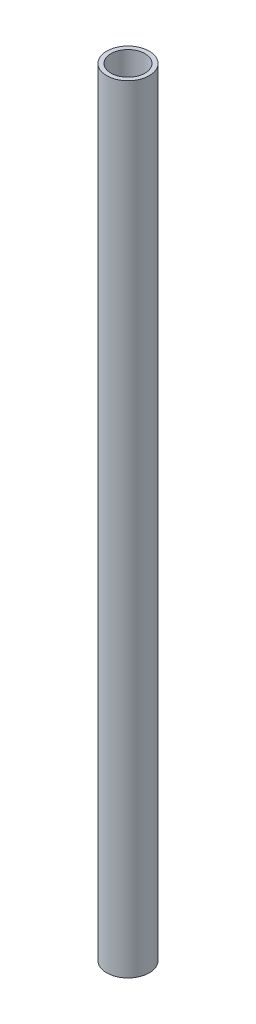
ISO-10303-21;
HEADER;
FILE_DESCRIPTION(('STEP AP214'),'2;1');
FILE_NAME('part.step','',(''),(''),'','','');
FILE_SCHEMA(('AUTOMOTIVE_DESIGN { 1 0 10303 214 1 1 1 1 }'));
ENDSEC;
DATA;
#1=APPLICATION_CONTEXT('core data for automotive mechanical design processes');
#2=APPLICATION_PROTOCOL_DEFINITION('international standard','automotive_design',2000,#1);
#3=PRODUCT_CONTEXT('',#1,'mechanical');
#4=PRODUCT('Part','Part','',(#3));
#5=PRODUCT_RELATED_PRODUCT_CATEGORY('part','',(#4));
#6=PRODUCT_DEFINITION_FORMATION('','',#4);
#7=PRODUCT_DEFINITION_CONTEXT('part definition',#1,'design');
#8=PRODUCT_DEFINITION('design','',#6,#7);
#9=PRODUCT_DEFINITION_SHAPE('','',#8);
#10=(LENGTH_UNIT() NAMED_UNIT(*) SI_UNIT(.MILLI.,.METRE.));
#11=(NAMED_UNIT(*) PLANE_ANGLE_UNIT() SI_UNIT($,.RADIAN.));
#12=(NAMED_UNIT(*) SI_UNIT($,.STERADIAN.) SOLID_ANGLE_UNIT());
#13=UNCERTAINTY_MEASURE_WITH_UNIT(LENGTH_MEASURE(1.E-05),#10,'distance_accuracy_value','');
#14=(GEOMETRIC_REPRESENTATION_CONTEXT(3) GLOBAL_UNCERTAINTY_ASSIGNED_CONTEXT((#13)) GLOBAL_UNIT_ASSIGNED_CONTEXT((#10,
#11,#12)) REPRESENTATION_CONTEXT('',''));
#15=CARTESIAN_POINT('',(0.,0.,0.));
#16=DIRECTION('',(0.,0.,1.));
#17=DIRECTION('',(1.,0.,0.));
#18=AXIS2_PLACEMENT_3D('',#15,#16,#17);
#19=CARTESIAN_POINT('',(0.,609.6,0.));
#20=DIRECTION('',(0.,1.,0.));
#21=DIRECTION('',(0.,0.,1.));
#22=AXIS2_PLACEMENT_3D('',#19,#20,#21);
#23=PLANE('',#22);
#24=CARTESIAN_POINT('',(0.,609.6,0.));
#25=DIRECTION('',(0.,1.,0.));
#26=DIRECTION('',(0.,0.,1.));
#27=AXIS2_PLACEMENT_3D('',#24,#25,#26);
#28=CIRCLE('',#27,16.7005);
#29=CARTESIAN_POINT('',(0.,609.6,16.7005));
#30=VERTEX_POINT('',#29);
#31=EDGE_CURVE('E10',#30,#30,#28,.T.);
#32=ORIENTED_EDGE('',*,*,#31,.T.);
#33=EDGE_LOOP('',(#32));
#34=FACE_BOUND('',#33,.T.);
#35=CARTESIAN_POINT('',(0.,609.6,0.));
#36=DIRECTION('',(0.,1.,0.));
#37=DIRECTION('',(0.,0.,1.));
#38=AXIS2_PLACEMENT_3D('',#35,#36,#37);
#39=CIRCLE('',#38,13.3223);
#40=CARTESIAN_POINT('',(0.,609.6,13.3223));
#41=VERTEX_POINT('',#40);
#42=EDGE_CURVE('E50',#41,#41,#39,.T.);
#43=ORIENTED_EDGE('',*,*,#42,.F.);
#44=EDGE_LOOP('',(#43));
#45=FACE_BOUND('',#44,.T.);
#46=ADVANCED_FACE('F39',(#34,#45),#23,.T.);
#47=CARTESIAN_POINT('',(0.,0.,0.));
#48=DIRECTION('',(0.,1.,0.));
#49=DIRECTION('',(0.,0.,1.));
#50=AXIS2_PLACEMENT_3D('',#47,#48,#49);
#51=PLANE('',#50);
#52=CARTESIAN_POINT('',(0.,0.,0.));
#53=DIRECTION('',(0.,1.,0.));
#54=DIRECTION('',(0.,0.,1.));
#55=AXIS2_PLACEMENT_3D('',#52,#53,#54);
#56=CIRCLE('',#55,16.7005);
#57=CARTESIAN_POINT('',(0.,0.,16.7005));
#58=VERTEX_POINT('',#57);
#59=EDGE_CURVE('E43',#58,#58,#56,.T.);
#60=ORIENTED_EDGE('',*,*,#59,.F.);
#61=EDGE_LOOP('',(#60));
#62=FACE_BOUND('',#61,.T.);
#63=CARTESIAN_POINT('',(0.,0.,0.));
#64=DIRECTION('',(0.,1.,0.));
#65=DIRECTION('',(0.,0.,1.));
#66=AXIS2_PLACEMENT_3D('',#63,#64,#65);
#67=CIRCLE('',#66,13.3223);
#68=CARTESIAN_POINT('',(0.,0.,13.3223));
#69=VERTEX_POINT('',#68);
#70=EDGE_CURVE('E52',#69,#69,#67,.T.);
#71=ORIENTED_EDGE('',*,*,#70,.T.);
#72=EDGE_LOOP('',(#71));
#73=FACE_BOUND('',#72,.T.);
#74=ADVANCED_FACE('F62',(#62,#73),#51,.F.);
#75=CARTESIAN_POINT('',(0.,609.6,0.));
#76=DIRECTION('',(0.,-1.,0.));
#77=DIRECTION('',(0.,0.,-1.));
#78=AXIS2_PLACEMENT_3D('',#75,#76,#77);
#79=CYLINDRICAL_SURFACE('',#78,16.7005);
#80=ORIENTED_EDGE('',*,*,#31,.F.);
#81=EDGE_LOOP('',(#80));
#82=FACE_BOUND('',#81,.T.);
#83=ORIENTED_EDGE('',*,*,#59,.T.);
#84=EDGE_LOOP('',(#83));
#85=FACE_BOUND('',#84,.T.);
#86=ADVANCED_FACE('F41',(#82,#85),#79,.T.);
#87=CARTESIAN_POINT('',(0.,609.6,0.));
#88=DIRECTION('',(0.,-1.,0.));
#89=DIRECTION('',(0.,0.,-1.));
#90=AXIS2_PLACEMENT_3D('',#87,#88,#89);
#91=CYLINDRICAL_SURFACE('',#90,13.3223);
#92=ORIENTED_EDGE('',*,*,#42,.T.);
#93=EDGE_LOOP('',(#92));
#94=FACE_BOUND('',#93,.T.);
#95=ORIENTED_EDGE('',*,*,#70,.F.);
#96=EDGE_LOOP('',(#95));
#97=FACE_BOUND('',#96,.T.);
#98=ADVANCED_FACE('F58',(#94,#97),#91,.F.);
#99=CLOSED_SHELL('',(#46,#74,#86,#98));
#100=MANIFOLD_SOLID_BREP('B2',#99);
#101=ADVANCED_BREP_SHAPE_REPRESENTATION('',(#18,#100),#14);
#102=SHAPE_DEFINITION_REPRESENTATION(#9,#101);
ENDSEC;
END-ISO-10303-21;
